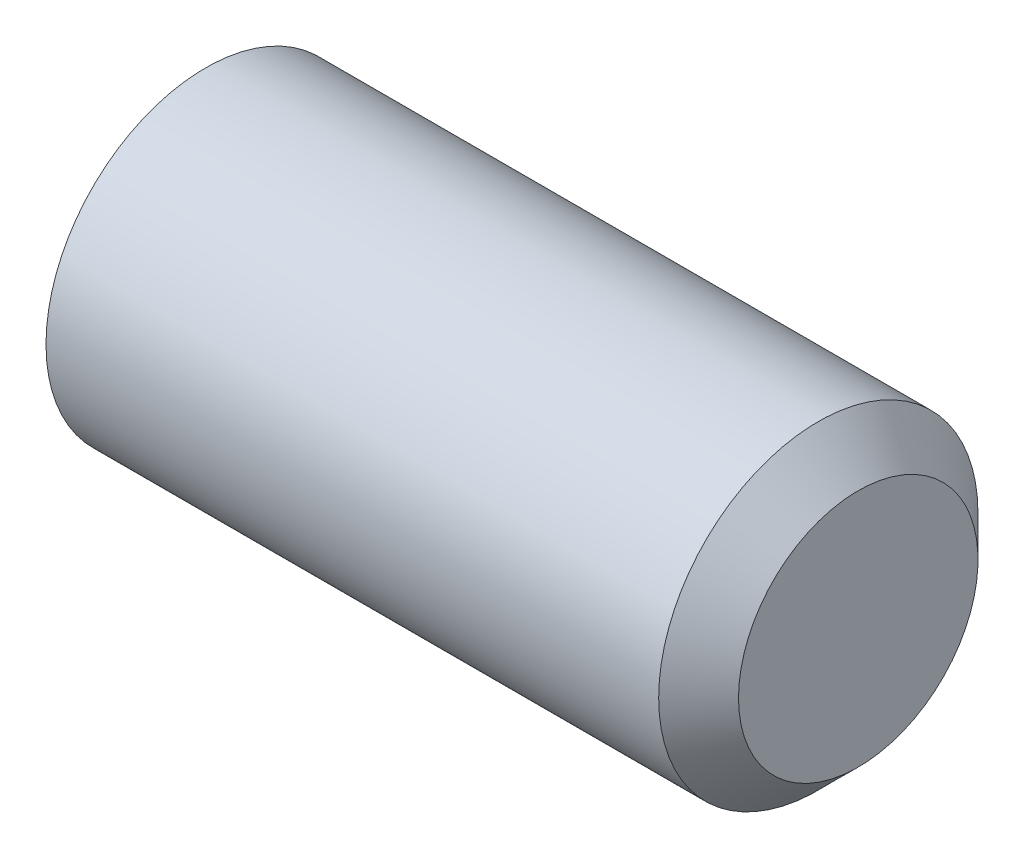
ISO-10303-21;
HEADER;
FILE_DESCRIPTION(('STEP AP214'),'2;1');
FILE_NAME('part.step','',(''),(''),'','','');
FILE_SCHEMA(('AUTOMOTIVE_DESIGN { 1 0 10303 214 1 1 1 1 }'));
ENDSEC;
DATA;
#1=APPLICATION_CONTEXT('core data for automotive mechanical design processes');
#2=APPLICATION_PROTOCOL_DEFINITION('international standard','automotive_design',2000,#1);
#3=PRODUCT_CONTEXT('',#1,'mechanical');
#4=PRODUCT('Part','Part','',(#3));
#5=PRODUCT_RELATED_PRODUCT_CATEGORY('part','',(#4));
#6=PRODUCT_DEFINITION_FORMATION('','',#4);
#7=PRODUCT_DEFINITION_CONTEXT('part definition',#1,'design');
#8=PRODUCT_DEFINITION('design','',#6,#7);
#9=PRODUCT_DEFINITION_SHAPE('','',#8);
#10=(LENGTH_UNIT() NAMED_UNIT(*) SI_UNIT(.MILLI.,.METRE.));
#11=(NAMED_UNIT(*) PLANE_ANGLE_UNIT() SI_UNIT($,.RADIAN.));
#12=(NAMED_UNIT(*) SI_UNIT($,.STERADIAN.) SOLID_ANGLE_UNIT());
#13=UNCERTAINTY_MEASURE_WITH_UNIT(LENGTH_MEASURE(1.E-05),#10,'distance_accuracy_value','');
#14=(GEOMETRIC_REPRESENTATION_CONTEXT(3) GLOBAL_UNCERTAINTY_ASSIGNED_CONTEXT((#13)) GLOBAL_UNIT_ASSIGNED_CONTEXT((#10,
#11,#12)) REPRESENTATION_CONTEXT('',''));
#15=CARTESIAN_POINT('',(0.,0.,0.));
#16=DIRECTION('',(0.,0.,1.));
#17=DIRECTION('',(1.,0.,0.));
#18=AXIS2_PLACEMENT_3D('',#15,#16,#17);
#19=CARTESIAN_POINT('',(0.,0.,0.));
#20=DIRECTION('',(-1.,0.,0.));
#21=DIRECTION('',(0.,0.,1.));
#22=AXIS2_PLACEMENT_3D('',#19,#20,#21);
#23=PLANE('',#22);
#24=CARTESIAN_POINT('',(0.,0.,0.));
#25=DIRECTION('',(-1.,0.,0.));
#26=DIRECTION('',(0.,0.,1.));
#27=AXIS2_PLACEMENT_3D('',#24,#25,#26);
#28=CIRCLE('',#27,10.352);
#29=CARTESIAN_POINT('',(0.,0.,10.352));
#30=VERTEX_POINT('',#29);
#31=EDGE_CURVE('E11',#30,#30,#28,.T.);
#32=ORIENTED_EDGE('',*,*,#31,.T.);
#33=EDGE_LOOP('',(#32));
#34=FACE_BOUND('',#33,.T.);
#35=DIRECTION('',(0.,0.,-1.));
#36=VECTOR('',#35,1.);
#37=CARTESIAN_POINT('',(0.,6.,3.46410161513775));
#38=LINE('',#37,#36);
#39=CARTESIAN_POINT('',(0.,6.,3.46410161513775));
#40=VERTEX_POINT('',#39);
#41=CARTESIAN_POINT('',(0.,6.,-3.46410161513776));
#42=VERTEX_POINT('',#41);
#43=EDGE_CURVE('E126',#40,#42,#38,.T.);
#44=ORIENTED_EDGE('',*,*,#43,.F.);
#45=DIRECTION('',(0.,-0.866025403784439,0.5));
#46=VECTOR('',#45,1.);
#47=CARTESIAN_POINT('',(0.,6.,3.46410161513775));
#48=LINE('',#47,#46);
#49=CARTESIAN_POINT('',(0.,0.,6.9282032302755));
#50=VERTEX_POINT('',#49);
#51=EDGE_CURVE('E48',#40,#50,#48,.T.);
#52=ORIENTED_EDGE('',*,*,#51,.T.);
#53=DIRECTION('',(0.,0.866025403784439,0.5));
#54=VECTOR('',#53,1.);
#55=CARTESIAN_POINT('',(0.,-5.99999999999999,3.46410161513775));
#56=LINE('',#55,#54);
#57=CARTESIAN_POINT('',(0.,-5.99999999999999,3.46410161513775));
#58=VERTEX_POINT('',#57);
#59=EDGE_CURVE('E117',#58,#50,#56,.T.);
#60=ORIENTED_EDGE('',*,*,#59,.F.);
#61=DIRECTION('',(0.,0.,-1.));
#62=VECTOR('',#61,1.);
#63=CARTESIAN_POINT('',(0.,-5.99999999999999,3.46410161513775));
#64=LINE('',#63,#62);
#65=CARTESIAN_POINT('',(0.,-5.99999999999999,-3.46410161513775));
#66=VERTEX_POINT('',#65);
#67=EDGE_CURVE('E120',#58,#66,#64,.T.);
#68=ORIENTED_EDGE('',*,*,#67,.T.);
#69=DIRECTION('',(0.,0.866025403784438,-0.5));
#70=VECTOR('',#69,1.);
#71=CARTESIAN_POINT('',(0.,-5.99999999999999,-3.46410161513775));
#72=LINE('',#71,#70);
#73=CARTESIAN_POINT('',(0.,0.,-6.92820323027551));
#74=VERTEX_POINT('',#73);
#75=EDGE_CURVE('E123',#66,#74,#72,.T.);
#76=ORIENTED_EDGE('',*,*,#75,.T.);
#77=DIRECTION('',(0.,-0.866025403784439,-0.5));
#78=VECTOR('',#77,1.);
#79=CARTESIAN_POINT('',(0.,6.,-3.46410161513776));
#80=LINE('',#79,#78);
#81=EDGE_CURVE('E106',#42,#74,#80,.T.);
#82=ORIENTED_EDGE('',*,*,#81,.F.);
#83=EDGE_LOOP('',(#44,#52,#60,#68,#76,#82));
#84=FACE_BOUND('',#83,.T.);
#85=ADVANCED_FACE('F34',(#34,#84),#23,.T.);
#86=CARTESIAN_POINT('',(0.,0.,0.));
#87=DIRECTION('',(1.,0.,0.));
#88=DIRECTION('',(0.,0.,-1.));
#89=AXIS2_PLACEMENT_3D('',#86,#87,#88);
#90=CONICAL_SURFACE('',#89,10.352,1.0471975511966);
#91=CARTESIAN_POINT('',(0.951473243624499,0.,0.));
#92=DIRECTION('',(-1.,0.,0.));
#93=DIRECTION('',(0.,0.,1.));
#94=AXIS2_PLACEMENT_3D('',#91,#92,#93);
#95=CIRCLE('',#94,12.);
#96=CARTESIAN_POINT('',(0.951473243624499,0.,12.));
#97=VERTEX_POINT('',#96);
#98=EDGE_CURVE('E41',#97,#97,#95,.T.);
#99=ORIENTED_EDGE('',*,*,#98,.T.);
#100=EDGE_LOOP('',(#99));
#101=FACE_BOUND('',#100,.T.);
#102=ORIENTED_EDGE('',*,*,#31,.F.);
#103=EDGE_LOOP('',(#102));
#104=FACE_BOUND('',#103,.T.);
#105=ADVANCED_FACE('F143',(#101,#104),#90,.T.);
#106=CARTESIAN_POINT('',(-12.7,0.,0.));
#107=DIRECTION('',(-1.,0.,0.));
#108=DIRECTION('',(0.,0.,1.));
#109=AXIS2_PLACEMENT_3D('',#106,#107,#108);
#110=CYLINDRICAL_SURFACE('',#109,12.);
#111=CARTESIAN_POINT('',(47.,0.,0.));
#112=DIRECTION('',(-1.,0.,0.));
#113=DIRECTION('',(0.,0.,1.));
#114=AXIS2_PLACEMENT_3D('',#111,#112,#113);
#115=CIRCLE('',#114,12.);
#116=CARTESIAN_POINT('',(47.,0.,12.));
#117=VERTEX_POINT('',#116);
#118=EDGE_CURVE('E138',#117,#117,#115,.T.);
#119=ORIENTED_EDGE('',*,*,#118,.T.);
#120=EDGE_LOOP('',(#119));
#121=FACE_BOUND('',#120,.T.);
#122=ORIENTED_EDGE('',*,*,#98,.F.);
#123=EDGE_LOOP('',(#122));
#124=FACE_BOUND('',#123,.T.);
#125=ADVANCED_FACE('F146',(#121,#124),#110,.T.);
#126=CARTESIAN_POINT('',(47.,0.,0.));
#127=DIRECTION('',(-1.,0.,0.));
#128=DIRECTION('',(0.,0.,1.));
#129=AXIS2_PLACEMENT_3D('',#126,#127,#128);
#130=CONICAL_SURFACE('',#129,12.,0.785398163397447);
#131=CARTESIAN_POINT('',(50.,0.,0.));
#132=DIRECTION('',(-1.,0.,0.));
#133=DIRECTION('',(0.,0.,1.));
#134=AXIS2_PLACEMENT_3D('',#131,#132,#133);
#135=CIRCLE('',#134,9.);
#136=CARTESIAN_POINT('',(50.,0.,9.));
#137=VERTEX_POINT('',#136);
#138=EDGE_CURVE('E135',#137,#137,#135,.T.);
#139=ORIENTED_EDGE('',*,*,#138,.T.);
#140=EDGE_LOOP('',(#139));
#141=FACE_BOUND('',#140,.T.);
#142=ORIENTED_EDGE('',*,*,#118,.F.);
#143=EDGE_LOOP('',(#142));
#144=FACE_BOUND('',#143,.T.);
#145=ADVANCED_FACE('F148',(#141,#144),#130,.T.);
#146=CARTESIAN_POINT('',(50.,9.,0.));
#147=DIRECTION('',(1.,0.,0.));
#148=DIRECTION('',(0.,0.,-1.));
#149=AXIS2_PLACEMENT_3D('',#146,#147,#148);
#150=PLANE('',#149);
#151=ORIENTED_EDGE('',*,*,#138,.F.);
#152=EDGE_LOOP('',(#151));
#153=FACE_BOUND('',#152,.T.);
#154=ADVANCED_FACE('F155',(#153),#150,.T.);
#155=CARTESIAN_POINT('',(15.,6.,3.46410161513775));
#156=DIRECTION('',(0.,-0.5,-0.866025403784439));
#157=DIRECTION('',(0.,0.866025403784439,-0.5));
#158=AXIS2_PLACEMENT_3D('',#155,#156,#157);
#159=PLANE('',#158);
#160=ORIENTED_EDGE('',*,*,#51,.F.);
#161=DIRECTION('',(-1.,0.,0.));
#162=VECTOR('',#161,1.);
#163=CARTESIAN_POINT('',(15.,6.,3.46410161513775));
#164=LINE('',#163,#162);
#165=CARTESIAN_POINT('',(15.,6.,3.46410161513775));
#166=VERTEX_POINT('',#165);
#167=EDGE_CURVE('E53',#166,#40,#164,.T.);
#168=ORIENTED_EDGE('',*,*,#167,.F.);
#169=DIRECTION('',(0.,-0.866025403784439,0.5));
#170=VECTOR('',#169,1.);
#171=CARTESIAN_POINT('',(15.,6.,3.46410161513775));
#172=LINE('',#171,#170);
#173=CARTESIAN_POINT('',(15.,0.,6.9282032302755));
#174=VERTEX_POINT('',#173);
#175=EDGE_CURVE('E80',#166,#174,#172,.T.);
#176=ORIENTED_EDGE('',*,*,#175,.T.);
#177=DIRECTION('',(-1.,0.,0.));
#178=VECTOR('',#177,1.);
#179=CARTESIAN_POINT('',(15.,0.,6.9282032302755));
#180=LINE('',#179,#178);
#181=EDGE_CURVE('E133',#174,#50,#180,.T.);
#182=ORIENTED_EDGE('',*,*,#181,.T.);
#183=EDGE_LOOP('',(#160,#168,#176,#182));
#184=FACE_BOUND('',#183,.T.);
#185=ADVANCED_FACE('F186',(#184),#159,.T.);
#186=CARTESIAN_POINT('',(15.,-5.99999999999999,3.46410161513775));
#187=DIRECTION('',(0.,-0.5,0.866025403784439));
#188=DIRECTION('',(0.,-0.866025403784439,-0.5));
#189=AXIS2_PLACEMENT_3D('',#186,#187,#188);
#190=PLANE('',#189);
#191=ORIENTED_EDGE('',*,*,#59,.T.);
#192=ORIENTED_EDGE('',*,*,#181,.F.);
#193=DIRECTION('',(0.,0.866025403784439,0.5));
#194=VECTOR('',#193,1.);
#195=CARTESIAN_POINT('',(15.,-5.99999999999999,3.46410161513775));
#196=LINE('',#195,#194);
#197=CARTESIAN_POINT('',(15.,-5.99999999999999,3.46410161513775));
#198=VERTEX_POINT('',#197);
#199=EDGE_CURVE('E266',#198,#174,#196,.T.);
#200=ORIENTED_EDGE('',*,*,#199,.F.);
#201=DIRECTION('',(-1.,0.,0.));
#202=VECTOR('',#201,1.);
#203=CARTESIAN_POINT('',(15.,-5.99999999999999,3.46410161513775));
#204=LINE('',#203,#202);
#205=EDGE_CURVE('E131',#198,#58,#204,.T.);
#206=ORIENTED_EDGE('',*,*,#205,.T.);
#207=EDGE_LOOP('',(#191,#192,#200,#206));
#208=FACE_BOUND('',#207,.T.);
#209=ADVANCED_FACE('F182',(#208),#190,.F.);
#210=CARTESIAN_POINT('',(15.,-5.99999999999999,3.46410161513775));
#211=DIRECTION('',(0.,1.,0.));
#212=DIRECTION('',(0.,0.,1.));
#213=AXIS2_PLACEMENT_3D('',#210,#211,#212);
#214=PLANE('',#213);
#215=ORIENTED_EDGE('',*,*,#67,.F.);
#216=ORIENTED_EDGE('',*,*,#205,.F.);
#217=DIRECTION('',(0.,0.,-1.));
#218=VECTOR('',#217,1.);
#219=CARTESIAN_POINT('',(15.,-5.99999999999999,3.46410161513775));
#220=LINE('',#219,#218);
#221=CARTESIAN_POINT('',(15.,-5.99999999999999,-3.46410161513775));
#222=VERTEX_POINT('',#221);
#223=EDGE_CURVE('E101',#198,#222,#220,.T.);
#224=ORIENTED_EDGE('',*,*,#223,.T.);
#225=DIRECTION('',(-1.,0.,0.));
#226=VECTOR('',#225,1.);
#227=CARTESIAN_POINT('',(15.,-5.99999999999999,-3.46410161513775));
#228=LINE('',#227,#226);
#229=EDGE_CURVE('E96',#222,#66,#228,.T.);
#230=ORIENTED_EDGE('',*,*,#229,.T.);
#231=EDGE_LOOP('',(#215,#216,#224,#230));
#232=FACE_BOUND('',#231,.T.);
#233=ADVANCED_FACE('F179',(#232),#214,.T.);
#234=CARTESIAN_POINT('',(15.,-5.99999999999999,-3.46410161513775));
#235=DIRECTION('',(0.,0.5,0.866025403784438));
#236=DIRECTION('',(0.,-0.866025403784438,0.5));
#237=AXIS2_PLACEMENT_3D('',#234,#235,#236);
#238=PLANE('',#237);
#239=ORIENTED_EDGE('',*,*,#75,.F.);
#240=ORIENTED_EDGE('',*,*,#229,.F.);
#241=DIRECTION('',(0.,0.866025403784438,-0.5));
#242=VECTOR('',#241,1.);
#243=CARTESIAN_POINT('',(15.,-5.99999999999999,-3.46410161513775));
#244=LINE('',#243,#242);
#245=CARTESIAN_POINT('',(15.,0.,-6.92820323027551));
#246=VERTEX_POINT('',#245);
#247=EDGE_CURVE('E91',#222,#246,#244,.T.);
#248=ORIENTED_EDGE('',*,*,#247,.T.);
#249=DIRECTION('',(-1.,0.,0.));
#250=VECTOR('',#249,1.);
#251=CARTESIAN_POINT('',(15.,0.,-6.92820323027551));
#252=LINE('',#251,#250);
#253=EDGE_CURVE('E95',#246,#74,#252,.T.);
#254=ORIENTED_EDGE('',*,*,#253,.T.);
#255=EDGE_LOOP('',(#239,#240,#248,#254));
#256=FACE_BOUND('',#255,.T.);
#257=ADVANCED_FACE('F94',(#256),#238,.T.);
#258=CARTESIAN_POINT('',(15.,6.,-3.46410161513776));
#259=DIRECTION('',(0.,0.5,-0.866025403784438));
#260=DIRECTION('',(0.,0.866025403784439,0.5));
#261=AXIS2_PLACEMENT_3D('',#258,#259,#260);
#262=PLANE('',#261);
#263=ORIENTED_EDGE('',*,*,#81,.T.);
#264=ORIENTED_EDGE('',*,*,#253,.F.);
#265=DIRECTION('',(0.,-0.866025403784439,-0.5));
#266=VECTOR('',#265,1.);
#267=CARTESIAN_POINT('',(15.,6.,-3.46410161513776));
#268=LINE('',#267,#266);
#269=CARTESIAN_POINT('',(15.,6.,-3.46410161513776));
#270=VERTEX_POINT('',#269);
#271=EDGE_CURVE('E100',#270,#246,#268,.T.);
#272=ORIENTED_EDGE('',*,*,#271,.F.);
#273=DIRECTION('',(-1.,0.,0.));
#274=VECTOR('',#273,1.);
#275=CARTESIAN_POINT('',(15.,6.,-3.46410161513776));
#276=LINE('',#275,#274);
#277=EDGE_CURVE('E76',#270,#42,#276,.T.);
#278=ORIENTED_EDGE('',*,*,#277,.T.);
#279=EDGE_LOOP('',(#263,#264,#272,#278));
#280=FACE_BOUND('',#279,.T.);
#281=ADVANCED_FACE('F103',(#280),#262,.F.);
#282=CARTESIAN_POINT('',(15.,6.,3.46410161513775));
#283=DIRECTION('',(0.,1.,0.));
#284=DIRECTION('',(0.,0.,1.));
#285=AXIS2_PLACEMENT_3D('',#282,#283,#284);
#286=PLANE('',#285);
#287=ORIENTED_EDGE('',*,*,#43,.T.);
#288=ORIENTED_EDGE('',*,*,#277,.F.);
#289=DIRECTION('',(0.,0.,-1.));
#290=VECTOR('',#289,1.);
#291=CARTESIAN_POINT('',(15.,6.,3.46410161513775));
#292=LINE('',#291,#290);
#293=EDGE_CURVE('E111',#166,#270,#292,.T.);
#294=ORIENTED_EDGE('',*,*,#293,.F.);
#295=ORIENTED_EDGE('',*,*,#167,.T.);
#296=EDGE_LOOP('',(#287,#288,#294,#295));
#297=FACE_BOUND('',#296,.T.);
#298=ADVANCED_FACE('F167',(#297),#286,.F.);
#299=CARTESIAN_POINT('',(15.,12.,0.));
#300=DIRECTION('',(1.,0.,0.));
#301=DIRECTION('',(0.,0.,-1.));
#302=AXIS2_PLACEMENT_3D('',#299,#300,#301);
#303=PLANE('',#302);
#304=ORIENTED_EDGE('',*,*,#175,.F.);
#305=ORIENTED_EDGE('',*,*,#293,.T.);
#306=ORIENTED_EDGE('',*,*,#271,.T.);
#307=ORIENTED_EDGE('',*,*,#247,.F.);
#308=ORIENTED_EDGE('',*,*,#223,.F.);
#309=ORIENTED_EDGE('',*,*,#199,.T.);
#310=EDGE_LOOP('',(#304,#305,#306,#307,#308,#309));
#311=FACE_BOUND('',#310,.T.);
#312=ADVANCED_FACE('F109',(#311),#303,.F.);
#313=CLOSED_SHELL('',(#85,#105,#125,#145,#154,#185,#209,#233,#257,#281,#298,#312));
#314=MANIFOLD_SOLID_BREP('B2',#313);
#315=ADVANCED_BREP_SHAPE_REPRESENTATION('',(#18,#314),#14);
#316=SHAPE_DEFINITION_REPRESENTATION(#9,#315);
ENDSEC;
END-ISO-10303-21;
